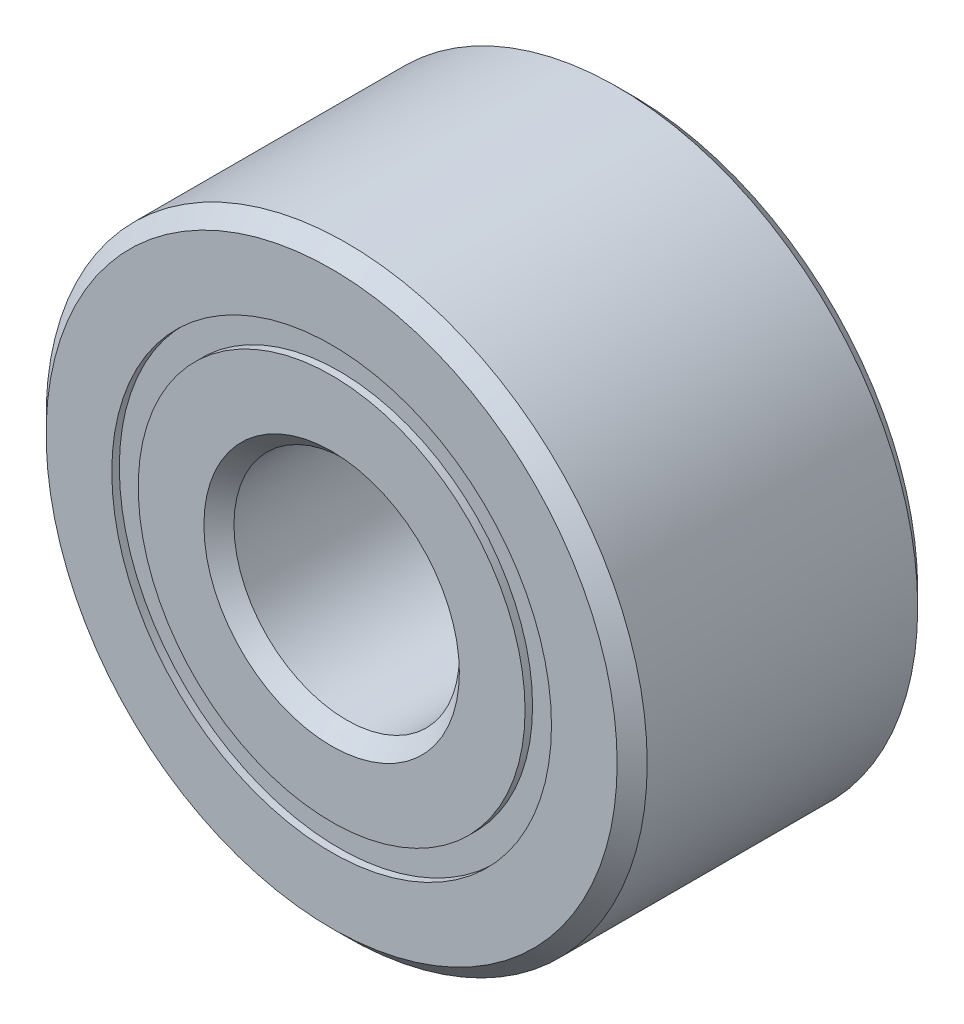
ISO-10303-21;
HEADER;
FILE_DESCRIPTION(('STEP AP214'),'2;1');
FILE_NAME('part.step','',(''),(''),'','','');
FILE_SCHEMA(('AUTOMOTIVE_DESIGN { 1 0 10303 214 1 1 1 1 }'));
ENDSEC;
DATA;
#1=APPLICATION_CONTEXT('core data for automotive mechanical design processes');
#2=APPLICATION_PROTOCOL_DEFINITION('international standard','automotive_design',2000,#1);
#3=PRODUCT_CONTEXT('',#1,'mechanical');
#4=PRODUCT('Part','Part','',(#3));
#5=PRODUCT_RELATED_PRODUCT_CATEGORY('part','',(#4));
#6=PRODUCT_DEFINITION_FORMATION('','',#4);
#7=PRODUCT_DEFINITION_CONTEXT('part definition',#1,'design');
#8=PRODUCT_DEFINITION('design','',#6,#7);
#9=PRODUCT_DEFINITION_SHAPE('','',#8);
#10=(LENGTH_UNIT() NAMED_UNIT(*) SI_UNIT(.MILLI.,.METRE.));
#11=(NAMED_UNIT(*) PLANE_ANGLE_UNIT() SI_UNIT($,.RADIAN.));
#12=(NAMED_UNIT(*) SI_UNIT($,.STERADIAN.) SOLID_ANGLE_UNIT());
#13=UNCERTAINTY_MEASURE_WITH_UNIT(LENGTH_MEASURE(1.E-05),#10,'distance_accuracy_value','');
#14=(GEOMETRIC_REPRESENTATION_CONTEXT(3) GLOBAL_UNCERTAINTY_ASSIGNED_CONTEXT((#13)) GLOBAL_UNIT_ASSIGNED_CONTEXT((#10,
#11,#12)) REPRESENTATION_CONTEXT('',''));
#15=CARTESIAN_POINT('',(0.,0.,0.));
#16=DIRECTION('',(0.,0.,1.));
#17=DIRECTION('',(1.,0.,0.));
#18=AXIS2_PLACEMENT_3D('',#15,#16,#17);
#19=CARTESIAN_POINT('',(0.,2.92582417582418,-1.9));
#20=DIRECTION('',(0.,0.,1.));
#21=DIRECTION('',(1.,0.,0.));
#22=AXIS2_PLACEMENT_3D('',#19,#20,#21);
#23=PLANE('',#22);
#24=CARTESIAN_POINT('',(0.,0.,-1.9));
#25=DIRECTION('',(0.,0.,1.));
#26=DIRECTION('',(1.,0.,0.));
#27=AXIS2_PLACEMENT_3D('',#24,#25,#26);
#28=CIRCLE('',#27,2.92582417582418);
#29=CARTESIAN_POINT('',(2.92582417582418,0.,-1.9));
#30=VERTEX_POINT('',#29);
#31=EDGE_CURVE('E58',#30,#30,#28,.T.);
#32=ORIENTED_EDGE('',*,*,#31,.F.);
#33=EDGE_LOOP('',(#32));
#34=FACE_BOUND('',#33,.T.);
#35=CARTESIAN_POINT('',(0.,0.,-1.9));
#36=DIRECTION('',(0.,0.,1.));
#37=DIRECTION('',(1.,0.,0.));
#38=AXIS2_PLACEMENT_3D('',#35,#36,#37);
#39=CIRCLE('',#38,2.57417582417583);
#40=CARTESIAN_POINT('',(2.57417582417583,0.,-1.9));
#41=VERTEX_POINT('',#40);
#42=EDGE_CURVE('E11',#41,#41,#39,.T.);
#43=ORIENTED_EDGE('',*,*,#42,.T.);
#44=EDGE_LOOP('',(#43));
#45=FACE_BOUND('',#44,.T.);
#46=ADVANCED_FACE('F44',(#34,#45),#23,.F.);
#47=CARTESIAN_POINT('',(0.,0.,2.));
#48=DIRECTION('',(0.,0.,1.));
#49=DIRECTION('',(1.,0.,0.));
#50=AXIS2_PLACEMENT_3D('',#47,#48,#49);
#51=CYLINDRICAL_SURFACE('',#50,2.57417582417583);
#52=ORIENTED_EDGE('',*,*,#42,.F.);
#53=EDGE_LOOP('',(#52));
#54=FACE_BOUND('',#53,.T.);
#55=CARTESIAN_POINT('',(0.,0.,-0.90611125012019));
#56=DIRECTION('',(0.,0.,1.));
#57=DIRECTION('',(1.,0.,0.));
#58=AXIS2_PLACEMENT_3D('',#55,#56,#57);
#59=CIRCLE('',#58,2.57417582417583);
#60=CARTESIAN_POINT('',(2.57417582417583,0.,-0.90611125012019));
#61=VERTEX_POINT('',#60);
#62=EDGE_CURVE('E50',#61,#61,#59,.T.);
#63=ORIENTED_EDGE('',*,*,#62,.T.);
#64=EDGE_LOOP('',(#63));
#65=FACE_BOUND('',#64,.T.);
#66=ADVANCED_FACE('F67',(#54,#65),#51,.F.);
#67=CARTESIAN_POINT('',(0.,2.92582417582418,-0.90611125012019));
#68=DIRECTION('',(0.,0.,-1.));
#69=DIRECTION('',(-1.,0.,0.));
#70=AXIS2_PLACEMENT_3D('',#67,#68,#69);
#71=PLANE('',#70);
#72=ORIENTED_EDGE('',*,*,#62,.F.);
#73=EDGE_LOOP('',(#72));
#74=FACE_BOUND('',#73,.T.);
#75=CARTESIAN_POINT('',(0.,0.,-0.90611125012019));
#76=DIRECTION('',(0.,0.,1.));
#77=DIRECTION('',(1.,0.,0.));
#78=AXIS2_PLACEMENT_3D('',#75,#76,#77);
#79=CIRCLE('',#78,2.92582417582418);
#80=CARTESIAN_POINT('',(2.92582417582418,0.,-0.90611125012019));
#81=VERTEX_POINT('',#80);
#82=EDGE_CURVE('E54',#81,#81,#79,.T.);
#83=ORIENTED_EDGE('',*,*,#82,.T.);
#84=EDGE_LOOP('',(#83));
#85=FACE_BOUND('',#84,.T.);
#86=ADVANCED_FACE('F71',(#74,#85),#71,.F.);
#87=CARTESIAN_POINT('',(0.,0.,2.));
#88=DIRECTION('',(0.,0.,1.));
#89=DIRECTION('',(1.,0.,0.));
#90=AXIS2_PLACEMENT_3D('',#87,#88,#89);
#91=CYLINDRICAL_SURFACE('',#90,2.92582417582418);
#92=ORIENTED_EDGE('',*,*,#82,.F.);
#93=EDGE_LOOP('',(#92));
#94=FACE_BOUND('',#93,.T.);
#95=ORIENTED_EDGE('',*,*,#31,.T.);
#96=EDGE_LOOP('',(#95));
#97=FACE_BOUND('',#96,.T.);
#98=ADVANCED_FACE('F64',(#94,#97),#91,.T.);
#99=CLOSED_SHELL('',(#46,#66,#86,#98));
#100=MANIFOLD_SOLID_BREP('B2',#99);
#101=CARTESIAN_POINT('',(0.,2.92582417582418,1.9));
#102=DIRECTION('',(0.,0.,-1.));
#103=DIRECTION('',(-1.,0.,0.));
#104=AXIS2_PLACEMENT_3D('',#101,#102,#103);
#105=PLANE('',#104);
#106=CARTESIAN_POINT('',(0.,0.,1.9));
#107=DIRECTION('',(0.,0.,1.));
#108=DIRECTION('',(1.,0.,0.));
#109=AXIS2_PLACEMENT_3D('',#106,#107,#108);
#110=CIRCLE('',#109,2.57417582417583);
#111=CARTESIAN_POINT('',(2.57417582417583,0.,1.9));
#112=VERTEX_POINT('',#111);
#113=EDGE_CURVE('E43',#112,#112,#110,.T.);
#114=ORIENTED_EDGE('',*,*,#113,.F.);
#115=EDGE_LOOP('',(#114));
#116=FACE_BOUND('',#115,.T.);
#117=CARTESIAN_POINT('',(0.,0.,1.9));
#118=DIRECTION('',(0.,0.,1.));
#119=DIRECTION('',(1.,0.,0.));
#120=AXIS2_PLACEMENT_3D('',#117,#118,#119);
#121=CIRCLE('',#120,2.92582417582418);
#122=CARTESIAN_POINT('',(2.92582417582418,0.,1.9));
#123=VERTEX_POINT('',#122);
#124=EDGE_CURVE('E126',#123,#123,#121,.T.);
#125=ORIENTED_EDGE('',*,*,#124,.T.);
#126=EDGE_LOOP('',(#125));
#127=FACE_BOUND('',#126,.T.);
#128=ADVANCED_FACE('F112',(#116,#127),#105,.F.);
#129=CARTESIAN_POINT('',(0.,0.,2.));
#130=DIRECTION('',(0.,0.,1.));
#131=DIRECTION('',(1.,0.,0.));
#132=AXIS2_PLACEMENT_3D('',#129,#130,#131);
#133=CYLINDRICAL_SURFACE('',#132,2.57417582417583);
#134=CARTESIAN_POINT('',(0.,0.,0.90611125012019));
#135=DIRECTION('',(0.,0.,1.));
#136=DIRECTION('',(1.,0.,0.));
#137=AXIS2_PLACEMENT_3D('',#134,#135,#136);
#138=CIRCLE('',#137,2.57417582417583);
#139=CARTESIAN_POINT('',(2.57417582417583,0.,0.90611125012019));
#140=VERTEX_POINT('',#139);
#141=EDGE_CURVE('E118',#140,#140,#138,.T.);
#142=ORIENTED_EDGE('',*,*,#141,.F.);
#143=EDGE_LOOP('',(#142));
#144=FACE_BOUND('',#143,.T.);
#145=ORIENTED_EDGE('',*,*,#113,.T.);
#146=EDGE_LOOP('',(#145));
#147=FACE_BOUND('',#146,.T.);
#148=ADVANCED_FACE('F141',(#144,#147),#133,.F.);
#149=CARTESIAN_POINT('',(0.,2.92582417582418,0.90611125012019));
#150=DIRECTION('',(0.,0.,1.));
#151=DIRECTION('',(1.,0.,0.));
#152=AXIS2_PLACEMENT_3D('',#149,#150,#151);
#153=PLANE('',#152);
#154=CARTESIAN_POINT('',(0.,0.,0.90611125012019));
#155=DIRECTION('',(0.,0.,1.));
#156=DIRECTION('',(1.,0.,0.));
#157=AXIS2_PLACEMENT_3D('',#154,#155,#156);
#158=CIRCLE('',#157,2.92582417582418);
#159=CARTESIAN_POINT('',(2.92582417582418,0.,0.90611125012019));
#160=VERTEX_POINT('',#159);
#161=EDGE_CURVE('E122',#160,#160,#158,.T.);
#162=ORIENTED_EDGE('',*,*,#161,.F.);
#163=EDGE_LOOP('',(#162));
#164=FACE_BOUND('',#163,.T.);
#165=ORIENTED_EDGE('',*,*,#141,.T.);
#166=EDGE_LOOP('',(#165));
#167=FACE_BOUND('',#166,.T.);
#168=ADVANCED_FACE('F136',(#164,#167),#153,.F.);
#169=CARTESIAN_POINT('',(0.,0.,2.));
#170=DIRECTION('',(0.,0.,1.));
#171=DIRECTION('',(1.,0.,0.));
#172=AXIS2_PLACEMENT_3D('',#169,#170,#171);
#173=CYLINDRICAL_SURFACE('',#172,2.92582417582418);
#174=ORIENTED_EDGE('',*,*,#124,.F.);
#175=EDGE_LOOP('',(#174));
#176=FACE_BOUND('',#175,.T.);
#177=ORIENTED_EDGE('',*,*,#161,.T.);
#178=EDGE_LOOP('',(#177));
#179=FACE_BOUND('',#178,.T.);
#180=ADVANCED_FACE('F133',(#176,#179),#173,.T.);
#181=CLOSED_SHELL('',(#128,#148,#168,#180));
#182=MANIFOLD_SOLID_BREP('B6',#181);
#183=CARTESIAN_POINT('',(-1.37499999999997,2.38156986040722,0.));
#184=DIRECTION('',(0.,0.,1.));
#185=DIRECTION('',(-0.499999999999989,0.866025403784445,0.));
#186=AXIS2_PLACEMENT_3D('',#183,#184,#185);
#187=SPHERICAL_SURFACE('',#186,0.90611125012019);
#188=CARTESIAN_POINT('',(-1.37499999999997,2.38156986040722,0.90611125012019));
#189=VERTEX_POINT('',#188);
#190=VERTEX_LOOP('',#189);
#191=FACE_BOUND('',#190,.T.);
#192=ADVANCED_FACE('F180',(#191),#187,.T.);
#193=CLOSED_SHELL('',(#192));
#194=MANIFOLD_SOLID_BREP('B38',#193);
#195=CARTESIAN_POINT('',(-2.38156986040719,1.37500000000003,0.));
#196=DIRECTION('',(0.,0.,1.));
#197=DIRECTION('',(-0.866025403784433,0.50000000000001,0.));
#198=AXIS2_PLACEMENT_3D('',#195,#196,#197);
#199=SPHERICAL_SURFACE('',#198,0.90611125012019);
#200=CARTESIAN_POINT('',(-2.38156986040719,1.37500000000003,0.90611125012019));
#201=VERTEX_POINT('',#200);
#202=VERTEX_LOOP('',#201);
#203=FACE_BOUND('',#202,.T.);
#204=ADVANCED_FACE('F201',(#203),#199,.T.);
#205=CLOSED_SHELL('',(#204));
#206=MANIFOLD_SOLID_BREP('B108',#205);
#207=CARTESIAN_POINT('',(-2.75,0.,0.));
#208=DIRECTION('',(0.,0.,1.));
#209=DIRECTION('',(-1.,0.,0.));
#210=AXIS2_PLACEMENT_3D('',#207,#208,#209);
#211=SPHERICAL_SURFACE('',#210,0.90611125012019);
#212=CARTESIAN_POINT('',(-2.75,0.,0.90611125012019));
#213=VERTEX_POINT('',#212);
#214=VERTEX_LOOP('',#213);
#215=FACE_BOUND('',#214,.T.);
#216=ADVANCED_FACE('F222',(#215),#211,.T.);
#217=CLOSED_SHELL('',(#216));
#218=MANIFOLD_SOLID_BREP('B176',#217);
#219=CARTESIAN_POINT('',(-2.38156986040722,-1.37499999999998,0.));
#220=DIRECTION('',(0.,0.,1.));
#221=DIRECTION('',(-0.866025403784443,-0.499999999999992,0.));
#222=AXIS2_PLACEMENT_3D('',#219,#220,#221);
#223=SPHERICAL_SURFACE('',#222,0.90611125012019);
#224=CARTESIAN_POINT('',(-2.38156986040722,-1.37499999999998,0.90611125012019));
#225=VERTEX_POINT('',#224);
#226=VERTEX_LOOP('',#225);
#227=FACE_BOUND('',#226,.T.);
#228=ADVANCED_FACE('F243',(#227),#223,.T.);
#229=CLOSED_SHELL('',(#228));
#230=MANIFOLD_SOLID_BREP('B197',#229);
#231=CARTESIAN_POINT('',(-1.37500000000002,-2.3815698604072,0.));
#232=DIRECTION('',(0.,0.,1.));
#233=DIRECTION('',(-0.500000000000007,-0.866025403784435,0.));
#234=AXIS2_PLACEMENT_3D('',#231,#232,#233);
#235=SPHERICAL_SURFACE('',#234,0.90611125012019);
#236=CARTESIAN_POINT('',(-1.37500000000002,-2.3815698604072,0.90611125012019));
#237=VERTEX_POINT('',#236);
#238=VERTEX_LOOP('',#237);
#239=FACE_BOUND('',#238,.T.);
#240=ADVANCED_FACE('F264',(#239),#235,.T.);
#241=CLOSED_SHELL('',(#240));
#242=MANIFOLD_SOLID_BREP('B218',#241);
#243=CARTESIAN_POINT('',(0.,-2.75,0.));
#244=DIRECTION('',(0.,0.,1.));
#245=DIRECTION('',(0.,-1.,0.));
#246=AXIS2_PLACEMENT_3D('',#243,#244,#245);
#247=SPHERICAL_SURFACE('',#246,0.90611125012019);
#248=CARTESIAN_POINT('',(0.,-2.75,0.90611125012019));
#249=VERTEX_POINT('',#248);
#250=VERTEX_LOOP('',#249);
#251=FACE_BOUND('',#250,.T.);
#252=ADVANCED_FACE('F285',(#251),#247,.T.);
#253=CLOSED_SHELL('',(#252));
#254=MANIFOLD_SOLID_BREP('B239',#253);
#255=CARTESIAN_POINT('',(1.37499999999999,-2.38156986040721,0.));
#256=DIRECTION('',(0.,0.,1.));
#257=DIRECTION('',(0.499999999999995,-0.866025403784442,0.));
#258=AXIS2_PLACEMENT_3D('',#255,#256,#257);
#259=SPHERICAL_SURFACE('',#258,0.90611125012019);
#260=CARTESIAN_POINT('',(1.37499999999999,-2.38156986040721,0.90611125012019));
#261=VERTEX_POINT('',#260);
#262=VERTEX_LOOP('',#261);
#263=FACE_BOUND('',#262,.T.);
#264=ADVANCED_FACE('F306',(#263),#259,.T.);
#265=CLOSED_SHELL('',(#264));
#266=MANIFOLD_SOLID_BREP('B260',#265);
#267=CARTESIAN_POINT('',(2.3815698604072,-1.37500000000001,0.));
#268=DIRECTION('',(0.,0.,1.));
#269=DIRECTION('',(0.866025403784436,-0.500000000000004,0.));
#270=AXIS2_PLACEMENT_3D('',#267,#268,#269);
#271=SPHERICAL_SURFACE('',#270,0.90611125012019);
#272=CARTESIAN_POINT('',(2.3815698604072,-1.37500000000001,0.90611125012019));
#273=VERTEX_POINT('',#272);
#274=VERTEX_LOOP('',#273);
#275=FACE_BOUND('',#274,.T.);
#276=ADVANCED_FACE('F327',(#275),#271,.T.);
#277=CLOSED_SHELL('',(#276));
#278=MANIFOLD_SOLID_BREP('B281',#277);
#279=CARTESIAN_POINT('',(2.75,0.,0.));
#280=DIRECTION('',(0.,0.,1.));
#281=DIRECTION('',(1.,0.,0.));
#282=AXIS2_PLACEMENT_3D('',#279,#280,#281);
#283=SPHERICAL_SURFACE('',#282,0.90611125012019);
#284=CARTESIAN_POINT('',(2.75,0.,0.90611125012019));
#285=VERTEX_POINT('',#284);
#286=VERTEX_LOOP('',#285);
#287=FACE_BOUND('',#286,.T.);
#288=ADVANCED_FACE('F348',(#287),#283,.T.);
#289=CLOSED_SHELL('',(#288));
#290=MANIFOLD_SOLID_BREP('B302',#289);
#291=CARTESIAN_POINT('',(2.38156986040721,1.37499999999999,0.));
#292=DIRECTION('',(0.,0.,1.));
#293=DIRECTION('',(0.86602540378444,0.499999999999998,0.));
#294=AXIS2_PLACEMENT_3D('',#291,#292,#293);
#295=SPHERICAL_SURFACE('',#294,0.90611125012019);
#296=CARTESIAN_POINT('',(2.38156986040721,1.37499999999999,0.90611125012019));
#297=VERTEX_POINT('',#296);
#298=VERTEX_LOOP('',#297);
#299=FACE_BOUND('',#298,.T.);
#300=ADVANCED_FACE('F369',(#299),#295,.T.);
#301=CLOSED_SHELL('',(#300));
#302=MANIFOLD_SOLID_BREP('B323',#301);
#303=CARTESIAN_POINT('',(1.375,2.3815698604072,0.));
#304=DIRECTION('',(0.,0.,1.));
#305=DIRECTION('',(0.500000000000001,0.866025403784438,0.));
#306=AXIS2_PLACEMENT_3D('',#303,#304,#305);
#307=SPHERICAL_SURFACE('',#306,0.90611125012019);
#308=CARTESIAN_POINT('',(1.375,2.3815698604072,0.90611125012019));
#309=VERTEX_POINT('',#308);
#310=VERTEX_LOOP('',#309);
#311=FACE_BOUND('',#310,.T.);
#312=ADVANCED_FACE('F390',(#311),#307,.T.);
#313=CLOSED_SHELL('',(#312));
#314=MANIFOLD_SOLID_BREP('B344',#313);
#315=CARTESIAN_POINT('',(0.,2.75,0.));
#316=DIRECTION('',(0.,0.,1.));
#317=DIRECTION('',(0.,1.,0.));
#318=AXIS2_PLACEMENT_3D('',#315,#316,#317);
#319=SPHERICAL_SURFACE('',#318,0.90611125012019);
#320=CARTESIAN_POINT('',(0.,2.75,0.90611125012019));
#321=VERTEX_POINT('',#320);
#322=VERTEX_LOOP('',#321);
#323=FACE_BOUND('',#322,.T.);
#324=ADVANCED_FACE('F413',(#323),#319,.T.);
#325=CLOSED_SHELL('',(#324));
#326=MANIFOLD_SOLID_BREP('B365',#325);
#327=CARTESIAN_POINT('',(0.,2.57417582417583,2.));
#328=DIRECTION('',(0.,0.,-1.));
#329=DIRECTION('',(-1.,0.,0.));
#330=AXIS2_PLACEMENT_3D('',#327,#328,#329);
#331=PLANE('',#330);
#332=CARTESIAN_POINT('',(0.,0.,2.));
#333=DIRECTION('',(0.,0.,1.));
#334=DIRECTION('',(1.,0.,0.));
#335=AXIS2_PLACEMENT_3D('',#332,#333,#334);
#336=CIRCLE('',#335,1.7);
#337=CARTESIAN_POINT('',(1.7,0.,2.));
#338=VERTEX_POINT('',#337);
#339=EDGE_CURVE('E461',#338,#338,#336,.T.);
#340=ORIENTED_EDGE('',*,*,#339,.F.);
#341=EDGE_LOOP('',(#340));
#342=FACE_BOUND('',#341,.T.);
#343=CARTESIAN_POINT('',(0.,0.,2.));
#344=DIRECTION('',(0.,0.,1.));
#345=DIRECTION('',(1.,0.,0.));
#346=AXIS2_PLACEMENT_3D('',#343,#344,#345);
#347=CIRCLE('',#346,2.57417582417583);
#348=CARTESIAN_POINT('',(2.57417582417583,0.,2.));
#349=VERTEX_POINT('',#348);
#350=EDGE_CURVE('E412',#349,#349,#347,.T.);
#351=ORIENTED_EDGE('',*,*,#350,.T.);
#352=EDGE_LOOP('',(#351));
#353=FACE_BOUND('',#352,.T.);
#354=ADVANCED_FACE('F433',(#342,#353),#331,.F.);
#355=CARTESIAN_POINT('',(0.,0.,2.));
#356=DIRECTION('',(0.,0.,1.));
#357=DIRECTION('',(1.,0.,0.));
#358=AXIS2_PLACEMENT_3D('',#355,#356,#357);
#359=CYLINDRICAL_SURFACE('',#358,2.57417582417583);
#360=ORIENTED_EDGE('',*,*,#350,.F.);
#361=EDGE_LOOP('',(#360));
#362=FACE_BOUND('',#361,.T.);
#363=CARTESIAN_POINT('',(0.,0.,0.888888888888889));
#364=DIRECTION('',(0.,0.,1.));
#365=DIRECTION('',(1.,0.,0.));
#366=AXIS2_PLACEMENT_3D('',#363,#364,#365);
#367=CIRCLE('',#366,2.57417582417583);
#368=CARTESIAN_POINT('',(2.57417582417583,0.,0.888888888888889));
#369=VERTEX_POINT('',#368);
#370=EDGE_CURVE('E439',#369,#369,#367,.T.);
#371=ORIENTED_EDGE('',*,*,#370,.T.);
#372=EDGE_LOOP('',(#371));
#373=FACE_BOUND('',#372,.T.);
#374=ADVANCED_FACE('F468',(#362,#373),#359,.T.);
#375=CARTESIAN_POINT('',(0.,0.,0.));
#376=DIRECTION('',(0.,0.,1.));
#377=DIRECTION('',(1.,0.,0.));
#378=AXIS2_PLACEMENT_3D('',#375,#376,#377);
#379=TOROIDAL_SURFACE('',#378,2.75,0.906111250120189);
#380=ORIENTED_EDGE('',*,*,#370,.F.);
#381=EDGE_LOOP('',(#380));
#382=FACE_BOUND('',#381,.T.);
#383=CARTESIAN_POINT('',(0.,0.,-0.88888888888889));
#384=DIRECTION('',(0.,0.,1.));
#385=DIRECTION('',(1.,0.,0.));
#386=AXIS2_PLACEMENT_3D('',#383,#384,#385);
#387=CIRCLE('',#386,2.57417582417583);
#388=CARTESIAN_POINT('',(2.57417582417583,0.,-0.88888888888889));
#389=VERTEX_POINT('',#388);
#390=EDGE_CURVE('E443',#389,#389,#387,.T.);
#391=ORIENTED_EDGE('',*,*,#390,.T.);
#392=EDGE_LOOP('',(#391));
#393=FACE_BOUND('',#392,.T.);
#394=ADVANCED_FACE('F472',(#382,#393),#379,.F.);
#395=CARTESIAN_POINT('',(0.,0.,2.));
#396=DIRECTION('',(0.,0.,1.));
#397=DIRECTION('',(1.,0.,0.));
#398=AXIS2_PLACEMENT_3D('',#395,#396,#397);
#399=CYLINDRICAL_SURFACE('',#398,2.57417582417583);
#400=ORIENTED_EDGE('',*,*,#390,.F.);
#401=EDGE_LOOP('',(#400));
#402=FACE_BOUND('',#401,.T.);
#403=CARTESIAN_POINT('',(0.,0.,-2.));
#404=DIRECTION('',(0.,0.,1.));
#405=DIRECTION('',(1.,0.,0.));
#406=AXIS2_PLACEMENT_3D('',#403,#404,#405);
#407=CIRCLE('',#406,2.57417582417583);
#408=CARTESIAN_POINT('',(2.57417582417583,0.,-2.));
#409=VERTEX_POINT('',#408);
#410=EDGE_CURVE('E447',#409,#409,#407,.T.);
#411=ORIENTED_EDGE('',*,*,#410,.T.);
#412=EDGE_LOOP('',(#411));
#413=FACE_BOUND('',#412,.T.);
#414=ADVANCED_FACE('F477',(#402,#413),#399,.T.);
#415=CARTESIAN_POINT('',(0.,1.7,-2.));
#416=DIRECTION('',(0.,0.,1.));
#417=DIRECTION('',(1.,0.,0.));
#418=AXIS2_PLACEMENT_3D('',#415,#416,#417);
#419=PLANE('',#418);
#420=ORIENTED_EDGE('',*,*,#410,.F.);
#421=EDGE_LOOP('',(#420));
#422=FACE_BOUND('',#421,.T.);
#423=CARTESIAN_POINT('',(0.,0.,-2.));
#424=DIRECTION('',(0.,0.,1.));
#425=DIRECTION('',(1.,0.,0.));
#426=AXIS2_PLACEMENT_3D('',#423,#424,#425);
#427=CIRCLE('',#426,1.7);
#428=CARTESIAN_POINT('',(1.7,0.,-2.));
#429=VERTEX_POINT('',#428);
#430=EDGE_CURVE('E452',#429,#429,#427,.T.);
#431=ORIENTED_EDGE('',*,*,#430,.T.);
#432=EDGE_LOOP('',(#431));
#433=FACE_BOUND('',#432,.T.);
#434=ADVANCED_FACE('F483',(#422,#433),#419,.F.);
#435=CARTESIAN_POINT('',(0.,0.,-1.8));
#436=DIRECTION('',(0.,0.,-1.));
#437=DIRECTION('',(-1.,0.,0.));
#438=AXIS2_PLACEMENT_3D('',#435,#436,#437);
#439=CONICAL_SURFACE('',#438,1.5,0.785398163397448);
#440=ORIENTED_EDGE('',*,*,#430,.F.);
#441=EDGE_LOOP('',(#440));
#442=FACE_BOUND('',#441,.T.);
#443=CARTESIAN_POINT('',(0.,0.,-1.8));
#444=DIRECTION('',(0.,0.,1.));
#445=DIRECTION('',(1.,0.,0.));
#446=AXIS2_PLACEMENT_3D('',#443,#444,#445);
#447=CIRCLE('',#446,1.5);
#448=CARTESIAN_POINT('',(1.5,0.,-1.8));
#449=VERTEX_POINT('',#448);
#450=EDGE_CURVE('E455',#449,#449,#447,.T.);
#451=ORIENTED_EDGE('',*,*,#450,.T.);
#452=EDGE_LOOP('',(#451));
#453=FACE_BOUND('',#452,.T.);
#454=ADVANCED_FACE('F487',(#442,#453),#439,.F.);
#455=CARTESIAN_POINT('',(0.,0.,2.));
#456=DIRECTION('',(0.,0.,1.));
#457=DIRECTION('',(1.,0.,0.));
#458=AXIS2_PLACEMENT_3D('',#455,#456,#457);
#459=CYLINDRICAL_SURFACE('',#458,1.5);
#460=ORIENTED_EDGE('',*,*,#450,.F.);
#461=EDGE_LOOP('',(#460));
#462=FACE_BOUND('',#461,.T.);
#463=CARTESIAN_POINT('',(0.,0.,1.8));
#464=DIRECTION('',(0.,0.,1.));
#465=DIRECTION('',(1.,0.,0.));
#466=AXIS2_PLACEMENT_3D('',#463,#464,#465);
#467=CIRCLE('',#466,1.5);
#468=CARTESIAN_POINT('',(1.5,0.,1.8));
#469=VERTEX_POINT('',#468);
#470=EDGE_CURVE('E458',#469,#469,#467,.T.);
#471=ORIENTED_EDGE('',*,*,#470,.T.);
#472=EDGE_LOOP('',(#471));
#473=FACE_BOUND('',#472,.T.);
#474=ADVANCED_FACE('F491',(#462,#473),#459,.F.);
#475=CARTESIAN_POINT('',(0.,0.,2.));
#476=DIRECTION('',(0.,0.,1.));
#477=DIRECTION('',(1.,0.,0.));
#478=AXIS2_PLACEMENT_3D('',#475,#476,#477);
#479=CONICAL_SURFACE('',#478,1.7,0.785398163397449);
#480=ORIENTED_EDGE('',*,*,#470,.F.);
#481=EDGE_LOOP('',(#480));
#482=FACE_BOUND('',#481,.T.);
#483=ORIENTED_EDGE('',*,*,#339,.T.);
#484=EDGE_LOOP('',(#483));
#485=FACE_BOUND('',#484,.T.);
#486=ADVANCED_FACE('F465',(#482,#485),#479,.F.);
#487=CLOSED_SHELL('',(#354,#374,#394,#414,#434,#454,#474,#486));
#488=MANIFOLD_SOLID_BREP('B386',#487);
#489=CARTESIAN_POINT('',(0.,0.,1.8));
#490=DIRECTION('',(0.,0.,-1.));
#491=DIRECTION('',(-1.,0.,0.));
#492=AXIS2_PLACEMENT_3D('',#489,#490,#491);
#493=CONICAL_SURFACE('',#492,4.,0.785398163397446);
#494=CARTESIAN_POINT('',(0.,0.,2.));
#495=DIRECTION('',(0.,0.,1.));
#496=DIRECTION('',(1.,0.,0.));
#497=AXIS2_PLACEMENT_3D('',#494,#495,#496);
#498=CIRCLE('',#497,3.8);
#499=CARTESIAN_POINT('',(3.8,0.,2.));
#500=VERTEX_POINT('',#499);
#501=EDGE_CURVE('E583',#500,#500,#498,.T.);
#502=ORIENTED_EDGE('',*,*,#501,.F.);
#503=EDGE_LOOP('',(#502));
#504=FACE_BOUND('',#503,.T.);
#505=CARTESIAN_POINT('',(0.,0.,1.8));
#506=DIRECTION('',(0.,0.,1.));
#507=DIRECTION('',(1.,0.,0.));
#508=AXIS2_PLACEMENT_3D('',#505,#506,#507);
#509=CIRCLE('',#508,4.);
#510=CARTESIAN_POINT('',(4.,0.,1.8));
#511=VERTEX_POINT('',#510);
#512=EDGE_CURVE('E432',#511,#511,#509,.T.);
#513=ORIENTED_EDGE('',*,*,#512,.T.);
#514=EDGE_LOOP('',(#513));
#515=FACE_BOUND('',#514,.T.);
#516=ADVANCED_FACE('F555',(#504,#515),#493,.T.);
#517=CARTESIAN_POINT('',(0.,0.,2.));
#518=DIRECTION('',(0.,0.,1.));
#519=DIRECTION('',(1.,0.,0.));
#520=AXIS2_PLACEMENT_3D('',#517,#518,#519);
#521=CYLINDRICAL_SURFACE('',#520,4.);
#522=ORIENTED_EDGE('',*,*,#512,.F.);
#523=EDGE_LOOP('',(#522));
#524=FACE_BOUND('',#523,.T.);
#525=CARTESIAN_POINT('',(0.,0.,-1.8));
#526=DIRECTION('',(0.,0.,1.));
#527=DIRECTION('',(1.,0.,0.));
#528=AXIS2_PLACEMENT_3D('',#525,#526,#527);
#529=CIRCLE('',#528,4.);
#530=CARTESIAN_POINT('',(4.,0.,-1.8));
#531=VERTEX_POINT('',#530);
#532=EDGE_CURVE('E561',#531,#531,#529,.T.);
#533=ORIENTED_EDGE('',*,*,#532,.T.);
#534=EDGE_LOOP('',(#533));
#535=FACE_BOUND('',#534,.T.);
#536=ADVANCED_FACE('F590',(#524,#535),#521,.T.);
#537=CARTESIAN_POINT('',(0.,0.,-2.));
#538=DIRECTION('',(0.,0.,1.));
#539=DIRECTION('',(1.,0.,0.));
#540=AXIS2_PLACEMENT_3D('',#537,#538,#539);
#541=CONICAL_SURFACE('',#540,3.8,0.785398163397447);
#542=ORIENTED_EDGE('',*,*,#532,.F.);
#543=EDGE_LOOP('',(#542));
#544=FACE_BOUND('',#543,.T.);
#545=CARTESIAN_POINT('',(0.,0.,-2.));
#546=DIRECTION('',(0.,0.,1.));
#547=DIRECTION('',(1.,0.,0.));
#548=AXIS2_PLACEMENT_3D('',#545,#546,#547);
#549=CIRCLE('',#548,3.8);
#550=CARTESIAN_POINT('',(3.8,0.,-2.));
#551=VERTEX_POINT('',#550);
#552=EDGE_CURVE('E565',#551,#551,#549,.T.);
#553=ORIENTED_EDGE('',*,*,#552,.T.);
#554=EDGE_LOOP('',(#553));
#555=FACE_BOUND('',#554,.T.);
#556=ADVANCED_FACE('F594',(#544,#555),#541,.T.);
#557=CARTESIAN_POINT('',(0.,3.8,-2.));
#558=DIRECTION('',(0.,0.,1.));
#559=DIRECTION('',(1.,0.,0.));
#560=AXIS2_PLACEMENT_3D('',#557,#558,#559);
#561=PLANE('',#560);
#562=ORIENTED_EDGE('',*,*,#552,.F.);
#563=EDGE_LOOP('',(#562));
#564=FACE_BOUND('',#563,.T.);
#565=CARTESIAN_POINT('',(0.,0.,-2.));
#566=DIRECTION('',(0.,0.,1.));
#567=DIRECTION('',(1.,0.,0.));
#568=AXIS2_PLACEMENT_3D('',#565,#566,#567);
#569=CIRCLE('',#568,2.92582417582418);
#570=CARTESIAN_POINT('',(2.92582417582418,0.,-2.));
#571=VERTEX_POINT('',#570);
#572=EDGE_CURVE('E569',#571,#571,#569,.T.);
#573=ORIENTED_EDGE('',*,*,#572,.T.);
#574=EDGE_LOOP('',(#573));
#575=FACE_BOUND('',#574,.T.);
#576=ADVANCED_FACE('F599',(#564,#575),#561,.F.);
#577=CARTESIAN_POINT('',(0.,0.,2.));
#578=DIRECTION('',(0.,0.,1.));
#579=DIRECTION('',(1.,0.,0.));
#580=AXIS2_PLACEMENT_3D('',#577,#578,#579);
#581=CYLINDRICAL_SURFACE('',#580,2.92582417582418);
#582=ORIENTED_EDGE('',*,*,#572,.F.);
#583=EDGE_LOOP('',(#582));
#584=FACE_BOUND('',#583,.T.);
#585=CARTESIAN_POINT('',(0.,0.,-0.888888888888889));
#586=DIRECTION('',(0.,0.,1.));
#587=DIRECTION('',(1.,0.,0.));
#588=AXIS2_PLACEMENT_3D('',#585,#586,#587);
#589=CIRCLE('',#588,2.92582417582418);
#590=CARTESIAN_POINT('',(2.92582417582418,0.,-0.888888888888889));
#591=VERTEX_POINT('',#590);
#592=EDGE_CURVE('E574',#591,#591,#589,.T.);
#593=ORIENTED_EDGE('',*,*,#592,.T.);
#594=EDGE_LOOP('',(#593));
#595=FACE_BOUND('',#594,.T.);
#596=ADVANCED_FACE('F605',(#584,#595),#581,.F.);
#597=CARTESIAN_POINT('',(0.,0.,0.));
#598=DIRECTION('',(0.,0.,1.));
#599=DIRECTION('',(1.,0.,0.));
#600=AXIS2_PLACEMENT_3D('',#597,#598,#599);
#601=TOROIDAL_SURFACE('',#600,2.75,0.90611125012019);
#602=ORIENTED_EDGE('',*,*,#592,.F.);
#603=EDGE_LOOP('',(#602));
#604=FACE_BOUND('',#603,.T.);
#605=CARTESIAN_POINT('',(0.,0.,0.888888888888889));
#606=DIRECTION('',(0.,0.,1.));
#607=DIRECTION('',(1.,0.,0.));
#608=AXIS2_PLACEMENT_3D('',#605,#606,#607);
#609=CIRCLE('',#608,2.92582417582418);
#610=CARTESIAN_POINT('',(2.92582417582418,0.,0.888888888888889));
#611=VERTEX_POINT('',#610);
#612=EDGE_CURVE('E577',#611,#611,#609,.T.);
#613=ORIENTED_EDGE('',*,*,#612,.T.);
#614=EDGE_LOOP('',(#613));
#615=FACE_BOUND('',#614,.T.);
#616=ADVANCED_FACE('F609',(#604,#615),#601,.F.);
#617=CARTESIAN_POINT('',(0.,0.,2.));
#618=DIRECTION('',(0.,0.,1.));
#619=DIRECTION('',(1.,0.,0.));
#620=AXIS2_PLACEMENT_3D('',#617,#618,#619);
#621=CYLINDRICAL_SURFACE('',#620,2.92582417582418);
#622=ORIENTED_EDGE('',*,*,#612,.F.);
#623=EDGE_LOOP('',(#622));
#624=FACE_BOUND('',#623,.T.);
#625=CARTESIAN_POINT('',(0.,0.,2.));
#626=DIRECTION('',(0.,0.,1.));
#627=DIRECTION('',(1.,0.,0.));
#628=AXIS2_PLACEMENT_3D('',#625,#626,#627);
#629=CIRCLE('',#628,2.92582417582418);
#630=CARTESIAN_POINT('',(2.92582417582418,0.,2.));
#631=VERTEX_POINT('',#630);
#632=EDGE_CURVE('E580',#631,#631,#629,.T.);
#633=ORIENTED_EDGE('',*,*,#632,.T.);
#634=EDGE_LOOP('',(#633));
#635=FACE_BOUND('',#634,.T.);
#636=ADVANCED_FACE('F613',(#624,#635),#621,.F.);
#637=CARTESIAN_POINT('',(0.,3.8,2.));
#638=DIRECTION('',(0.,0.,-1.));
#639=DIRECTION('',(-1.,0.,0.));
#640=AXIS2_PLACEMENT_3D('',#637,#638,#639);
#641=PLANE('',#640);
#642=ORIENTED_EDGE('',*,*,#632,.F.);
#643=EDGE_LOOP('',(#642));
#644=FACE_BOUND('',#643,.T.);
#645=ORIENTED_EDGE('',*,*,#501,.T.);
#646=EDGE_LOOP('',(#645));
#647=FACE_BOUND('',#646,.T.);
#648=ADVANCED_FACE('F587',(#644,#647),#641,.F.);
#649=CLOSED_SHELL('',(#516,#536,#556,#576,#596,#616,#636,#648));
#650=MANIFOLD_SOLID_BREP('B407',#649);
#651=ADVANCED_BREP_SHAPE_REPRESENTATION('',(#18,#100,#182,#194,#206,#218,#230,#242,#254,#266,
#278,#290,#302,#314,#326,#488,#650),#14);
#652=SHAPE_DEFINITION_REPRESENTATION(#9,#651);
ENDSEC;
END-ISO-10303-21;
